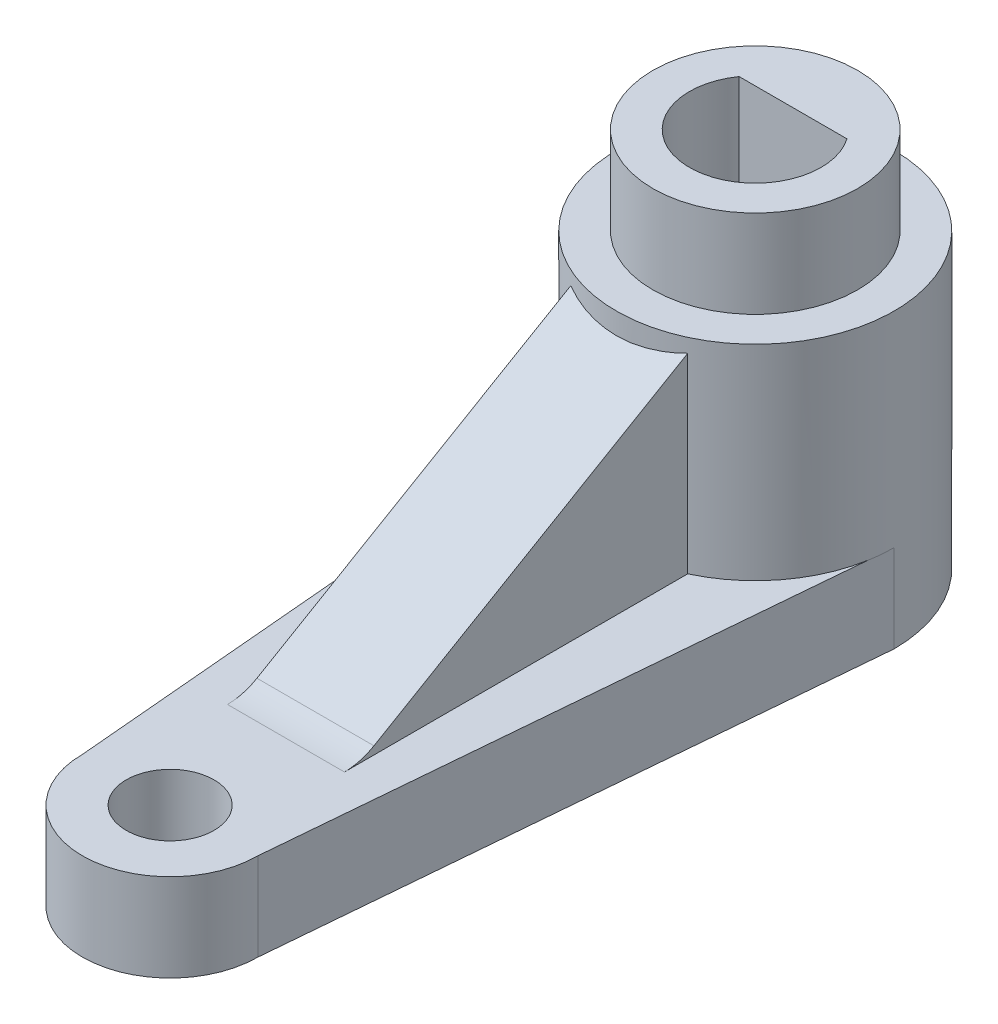
ISO-10303-21;
HEADER;
FILE_DESCRIPTION(('STEP AP214'),'2;1');
FILE_NAME('part.step','',(''),(''),'','','');
FILE_SCHEMA(('AUTOMOTIVE_DESIGN { 1 0 10303 214 1 1 1 1 }'));
ENDSEC;
DATA;
#1=APPLICATION_CONTEXT('core data for automotive mechanical design processes');
#2=APPLICATION_PROTOCOL_DEFINITION('international standard','automotive_design',2000,#1);
#3=PRODUCT_CONTEXT('',#1,'mechanical');
#4=PRODUCT('Part','Part','',(#3));
#5=PRODUCT_RELATED_PRODUCT_CATEGORY('part','',(#4));
#6=PRODUCT_DEFINITION_FORMATION('','',#4);
#7=PRODUCT_DEFINITION_CONTEXT('part definition',#1,'design');
#8=PRODUCT_DEFINITION('design','',#6,#7);
#9=PRODUCT_DEFINITION_SHAPE('','',#8);
#10=(LENGTH_UNIT() NAMED_UNIT(*) SI_UNIT(.MILLI.,.METRE.));
#11=(NAMED_UNIT(*) PLANE_ANGLE_UNIT() SI_UNIT($,.RADIAN.));
#12=(NAMED_UNIT(*) SI_UNIT($,.STERADIAN.) SOLID_ANGLE_UNIT());
#13=UNCERTAINTY_MEASURE_WITH_UNIT(LENGTH_MEASURE(1.E-05),#10,'distance_accuracy_value','');
#14=(GEOMETRIC_REPRESENTATION_CONTEXT(3) GLOBAL_UNCERTAINTY_ASSIGNED_CONTEXT((#13)) GLOBAL_UNIT_ASSIGNED_CONTEXT((#10,
#11,#12)) REPRESENTATION_CONTEXT('',''));
#15=CARTESIAN_POINT('',(0.,0.,0.));
#16=DIRECTION('',(0.,0.,1.));
#17=DIRECTION('',(1.,0.,0.));
#18=AXIS2_PLACEMENT_3D('',#15,#16,#17);
#19=CARTESIAN_POINT('',(0.,13.,0.));
#20=DIRECTION('',(0.,-1.,0.));
#21=DIRECTION('',(0.,0.,1.));
#22=AXIS2_PLACEMENT_3D('',#19,#20,#21);
#23=CYLINDRICAL_SURFACE('',#22,3.5);
#24=CARTESIAN_POINT('',(0.,13.,0.));
#25=DIRECTION('',(0.,-1.,0.));
#26=DIRECTION('',(0.,0.,-1.));
#27=AXIS2_PLACEMENT_3D('',#24,#25,#26);
#28=CIRCLE('',#27,3.5);
#29=CARTESIAN_POINT('',(0.,13.,-3.5));
#30=VERTEX_POINT('',#29);
#31=EDGE_CURVE('E223',#30,#30,#28,.T.);
#32=ORIENTED_EDGE('',*,*,#31,.T.);
#33=EDGE_LOOP('',(#32));
#34=FACE_BOUND('',#33,.T.);
#35=CARTESIAN_POINT('',(0.,10.,0.));
#36=DIRECTION('',(0.,-1.,0.));
#37=DIRECTION('',(0.,0.,-1.));
#38=AXIS2_PLACEMENT_3D('',#35,#36,#37);
#39=CIRCLE('',#38,3.5);
#40=CARTESIAN_POINT('',(0.,10.,-3.5));
#41=VERTEX_POINT('',#40);
#42=EDGE_CURVE('E298',#41,#41,#39,.T.);
#43=ORIENTED_EDGE('',*,*,#42,.F.);
#44=EDGE_LOOP('',(#43));
#45=FACE_BOUND('',#44,.T.);
#46=ADVANCED_FACE('F43',(#34,#45),#23,.T.);
#47=CARTESIAN_POINT('',(0.,3.,0.));
#48=DIRECTION('',(0.,-1.,0.));
#49=DIRECTION('',(0.,0.,1.));
#50=AXIS2_PLACEMENT_3D('',#47,#48,#49);
#51=CYLINDRICAL_SURFACE('',#50,2.25);
#52=DIRECTION('',(0.,-1.,0.));
#53=VECTOR('',#52,1.);
#54=CARTESIAN_POINT('',(-1.84347497948846,3.,-1.29));
#55=LINE('',#54,#53);
#56=CARTESIAN_POINT('',(-1.84347497948846,13.,-1.29));
#57=VERTEX_POINT('',#56);
#58=CARTESIAN_POINT('',(-1.84347497948846,1.5,-1.29));
#59=VERTEX_POINT('',#58);
#60=EDGE_CURVE('E236',#57,#59,#55,.T.);
#61=ORIENTED_EDGE('',*,*,#60,.F.);
#62=CARTESIAN_POINT('',(0.,13.,0.));
#63=DIRECTION('',(0.,-1.,0.));
#64=DIRECTION('',(0.,0.,-1.));
#65=AXIS2_PLACEMENT_3D('',#62,#63,#64);
#66=CIRCLE('',#65,2.25);
#67=CARTESIAN_POINT('',(1.84347497948846,13.,-1.29));
#68=VERTEX_POINT('',#67);
#69=EDGE_CURVE('E218',#68,#57,#66,.T.);
#70=ORIENTED_EDGE('',*,*,#69,.F.);
#71=DIRECTION('',(0.,-1.,0.));
#72=VECTOR('',#71,1.);
#73=CARTESIAN_POINT('',(1.84347497948846,3.,-1.29));
#74=LINE('',#73,#72);
#75=CARTESIAN_POINT('',(1.84347497948846,1.5,-1.29));
#76=VERTEX_POINT('',#75);
#77=EDGE_CURVE('E253',#68,#76,#74,.T.);
#78=ORIENTED_EDGE('',*,*,#77,.T.);
#79=CARTESIAN_POINT('',(0.,1.5,0.));
#80=DIRECTION('',(0.,1.,0.));
#81=DIRECTION('',(0.,0.,1.));
#82=AXIS2_PLACEMENT_3D('',#79,#80,#81);
#83=CIRCLE('',#82,2.25);
#84=EDGE_CURVE('E209',#59,#76,#83,.T.);
#85=ORIENTED_EDGE('',*,*,#84,.F.);
#86=EDGE_LOOP('',(#61,#70,#78,#85));
#87=FACE_BOUND('',#86,.T.);
#88=ADVANCED_FACE('F344',(#87),#51,.F.);
#89=CARTESIAN_POINT('',(0.,3.,-1.29));
#90=DIRECTION('',(0.,0.,1.));
#91=DIRECTION('',(-1.,0.,0.));
#92=AXIS2_PLACEMENT_3D('',#89,#90,#91);
#93=PLANE('',#92);
#94=ORIENTED_EDGE('',*,*,#77,.F.);
#95=DIRECTION('',(1.,0.,0.));
#96=VECTOR('',#95,1.);
#97=CARTESIAN_POINT('',(-1.84347497948846,13.,-1.29));
#98=LINE('',#97,#96);
#99=EDGE_CURVE('E221',#57,#68,#98,.T.);
#100=ORIENTED_EDGE('',*,*,#99,.F.);
#101=ORIENTED_EDGE('',*,*,#60,.T.);
#102=DIRECTION('',(-1.,0.,0.));
#103=VECTOR('',#102,1.);
#104=CARTESIAN_POINT('',(0.,1.5,-1.29));
#105=LINE('',#104,#103);
#106=EDGE_CURVE('E261',#76,#59,#105,.T.);
#107=ORIENTED_EDGE('',*,*,#106,.F.);
#108=EDGE_LOOP('',(#94,#100,#101,#107));
#109=FACE_BOUND('',#108,.T.);
#110=ADVANCED_FACE('F350',(#109),#93,.T.);
#111=CARTESIAN_POINT('',(0.,13.,0.));
#112=DIRECTION('',(0.,1.,0.));
#113=DIRECTION('',(0.,0.,-1.));
#114=AXIS2_PLACEMENT_3D('',#111,#112,#113);
#115=PLANE('',#114);
#116=ORIENTED_EDGE('',*,*,#31,.F.);
#117=EDGE_LOOP('',(#116));
#118=FACE_BOUND('',#117,.T.);
#119=ORIENTED_EDGE('',*,*,#99,.T.);
#120=ORIENTED_EDGE('',*,*,#69,.T.);
#121=EDGE_LOOP('',(#119,#120));
#122=FACE_BOUND('',#121,.T.);
#123=ADVANCED_FACE('F338',(#118,#122),#115,.T.);
#124=CARTESIAN_POINT('',(0.,1.5,0.));
#125=DIRECTION('',(0.,-1.,0.));
#126=DIRECTION('',(0.,0.,1.));
#127=AXIS2_PLACEMENT_3D('',#124,#125,#126);
#128=PLANE('',#127);
#129=ORIENTED_EDGE('',*,*,#84,.T.);
#130=ORIENTED_EDGE('',*,*,#106,.T.);
#131=EDGE_LOOP('',(#129,#130));
#132=FACE_BOUND('',#131,.T.);
#133=ADVANCED_FACE('F328',(#132),#128,.F.);
#134=CARTESIAN_POINT('',(0.,10.,0.));
#135=DIRECTION('',(0.,1.,0.));
#136=DIRECTION('',(0.,0.,-1.));
#137=AXIS2_PLACEMENT_3D('',#134,#135,#136);
#138=PLANE('',#137);
#139=ORIENTED_EDGE('',*,*,#42,.T.);
#140=EDGE_LOOP('',(#139));
#141=FACE_BOUND('',#140,.T.);
#142=CARTESIAN_POINT('',(0.,10.,0.));
#143=DIRECTION('',(0.,-1.,0.));
#144=DIRECTION('',(0.,0.,-1.));
#145=AXIS2_PLACEMENT_3D('',#142,#143,#144);
#146=CIRCLE('',#145,4.75);
#147=CARTESIAN_POINT('',(0.,10.,-4.75));
#148=VERTEX_POINT('',#147);
#149=EDGE_CURVE('E318',#148,#148,#146,.T.);
#150=ORIENTED_EDGE('',*,*,#149,.F.);
#151=EDGE_LOOP('',(#150));
#152=FACE_BOUND('',#151,.T.);
#153=ADVANCED_FACE('F325',(#141,#152),#138,.T.);
#154=CARTESIAN_POINT('',(0.,3.,0.));
#155=DIRECTION('',(0.,1.,0.));
#156=DIRECTION('',(0.,0.,-1.));
#157=AXIS2_PLACEMENT_3D('',#154,#155,#156);
#158=PLANE('',#157);
#159=CARTESIAN_POINT('',(0.,3.,0.));
#160=DIRECTION('',(0.,-1.,0.));
#161=DIRECTION('',(0.,0.,-1.));
#162=AXIS2_PLACEMENT_3D('',#159,#160,#161);
#163=CIRCLE('',#162,4.75);
#164=CARTESIAN_POINT('',(-4.67781826639789,3.,0.824934098309808));
#165=VERTEX_POINT('',#164);
#166=CARTESIAN_POINT('',(-4.75,3.,0.));
#167=VERTEX_POINT('',#166);
#168=EDGE_CURVE('E321',#165,#167,#163,.T.);
#169=ORIENTED_EDGE('',*,*,#168,.T.);
#170=DIRECTION('',(-0.0871669502809099,0.,-0.996193717496113));
#171=VECTOR('',#170,1.);
#172=CARTESIAN_POINT('',(-4.71390913319894,3.,0.412467049154908));
#173=LINE('',#172,#171);
#174=EDGE_CURVE('E314',#165,#167,#173,.T.);
#175=ORIENTED_EDGE('',*,*,#174,.F.);
#176=EDGE_LOOP('',(#169,#175));
#177=FACE_BOUND('',#176,.T.);
#178=ADVANCED_FACE('F327',(#177),#158,.F.);
#179=DIRECTION('',(0.0871669502809099,0.,-0.996193717496113));
#180=VECTOR('',#179,1.);
#181=CARTESIAN_POINT('',(4.71390913319894,3.,0.412467049154908));
#182=LINE('',#181,#180);
#183=CARTESIAN_POINT('',(4.67781826639789,3.,0.824934098309808));
#184=VERTEX_POINT('',#183);
#185=CARTESIAN_POINT('',(4.75,3.,0.));
#186=VERTEX_POINT('',#185);
#187=EDGE_CURVE('E312',#184,#186,#182,.T.);
#188=ORIENTED_EDGE('',*,*,#187,.T.);
#189=EDGE_CURVE('E319',#186,#184,#163,.T.);
#190=ORIENTED_EDGE('',*,*,#189,.T.);
#191=EDGE_LOOP('',(#188,#190));
#192=FACE_BOUND('',#191,.T.);
#193=ADVANCED_FACE('F335',(#192),#158,.F.);
#194=CARTESIAN_POINT('',(0.,1.,0.));
#195=DIRECTION('',(0.,1.,0.));
#196=DIRECTION('',(0.,0.,-1.));
#197=AXIS2_PLACEMENT_3D('',#194,#195,#196);
#198=PLANE('',#197);
#199=DIRECTION('',(-1.,0.,0.));
#200=VECTOR('',#199,1.);
#201=CARTESIAN_POINT('',(3.,1.,-2.));
#202=LINE('',#201,#200);
#203=CARTESIAN_POINT('',(1.22930936742544,1.,-2.));
#204=VERTEX_POINT('',#203);
#205=CARTESIAN_POINT('',(-1.22930936742545,1.,-2.));
#206=VERTEX_POINT('',#205);
#207=EDGE_CURVE('E202',#204,#206,#202,.T.);
#208=ORIENTED_EDGE('',*,*,#207,.F.);
#209=CARTESIAN_POINT('',(1.22930936742544,1.,-0.5));
#210=DIRECTION('',(0.,-1.,0.));
#211=DIRECTION('',(0.,0.,-1.));
#212=AXIS2_PLACEMENT_3D('',#209,#210,#211);
#213=CIRCLE('',#212,1.5);
#214=CARTESIAN_POINT('',(2.70890025317366,1.,-0.253401519041965));
#215=VERTEX_POINT('',#214);
#216=EDGE_CURVE('E280',#215,#204,#213,.F.);
#217=ORIENTED_EDGE('',*,*,#216,.F.);
#218=DIRECTION('',(0.164398987305357,0.,-0.986393923832144));
#219=VECTOR('',#218,1.);
#220=CARTESIAN_POINT('',(3.,1.,-2.));
#221=LINE('',#220,#219);
#222=CARTESIAN_POINT('',(1.47959088574822,1.,7.12245468551071));
#223=VERTEX_POINT('',#222);
#224=EDGE_CURVE('E199',#223,#215,#221,.T.);
#225=ORIENTED_EDGE('',*,*,#224,.F.);
#226=CARTESIAN_POINT('',(0.,1.,6.87585620455267));
#227=DIRECTION('',(0.,-1.,0.));
#228=DIRECTION('',(0.,0.,-1.));
#229=AXIS2_PLACEMENT_3D('',#226,#227,#228);
#230=CIRCLE('',#229,1.5);
#231=CARTESIAN_POINT('',(-1.47959088574821,1.,7.1224546855107));
#232=VERTEX_POINT('',#231);
#233=EDGE_CURVE('E277',#232,#223,#230,.F.);
#234=ORIENTED_EDGE('',*,*,#233,.F.);
#235=DIRECTION('',(0.164398987305357,0.,0.986393923832144));
#236=VECTOR('',#235,1.);
#237=CARTESIAN_POINT('',(-3.,1.,-2.));
#238=LINE('',#237,#236);
#239=CARTESIAN_POINT('',(-2.70890025317366,1.,-0.253401519041964));
#240=VERTEX_POINT('',#239);
#241=EDGE_CURVE('E206',#240,#232,#238,.T.);
#242=ORIENTED_EDGE('',*,*,#241,.F.);
#243=CARTESIAN_POINT('',(-1.22930936742544,1.,-0.5));
#244=DIRECTION('',(0.,-1.,0.));
#245=DIRECTION('',(0.,0.,-1.));
#246=AXIS2_PLACEMENT_3D('',#243,#244,#245);
#247=CIRCLE('',#246,1.5);
#248=EDGE_CURVE('E283',#206,#240,#247,.F.);
#249=ORIENTED_EDGE('',*,*,#248,.F.);
#250=EDGE_LOOP('',(#208,#217,#225,#234,#242,#249));
#251=FACE_BOUND('',#250,.T.);
#252=ADVANCED_FACE('F389',(#251),#198,.F.);
#253=CARTESIAN_POINT('',(-1.22930936742544,1.,-0.5));
#254=DIRECTION('',(0.,1.,0.));
#255=DIRECTION('',(0.,0.,-1.));
#256=AXIS2_PLACEMENT_3D('',#253,#254,#255);
#257=CYLINDRICAL_SURFACE('',#256,1.5);
#258=ORIENTED_EDGE('',*,*,#248,.T.);
#259=DIRECTION('',(0.,-1.,0.));
#260=VECTOR('',#259,1.);
#261=CARTESIAN_POINT('',(-2.70890025317366,0.,-0.253401519041964));
#262=LINE('',#261,#260);
#263=CARTESIAN_POINT('',(-2.70890025317366,0.,-0.253401519041964));
#264=VERTEX_POINT('',#263);
#265=EDGE_CURVE('E269',#240,#264,#262,.T.);
#266=ORIENTED_EDGE('',*,*,#265,.T.);
#267=CARTESIAN_POINT('',(-1.22930936742544,0.,-0.5));
#268=DIRECTION('',(0.,-1.,0.));
#269=DIRECTION('',(0.,0.,-1.));
#270=AXIS2_PLACEMENT_3D('',#267,#268,#269);
#271=CIRCLE('',#270,1.5);
#272=CARTESIAN_POINT('',(-1.22930936742545,0.,-2.));
#273=VERTEX_POINT('',#272);
#274=EDGE_CURVE('E291',#264,#273,#271,.T.);
#275=ORIENTED_EDGE('',*,*,#274,.T.);
#276=DIRECTION('',(0.,-1.,0.));
#277=VECTOR('',#276,1.);
#278=CARTESIAN_POINT('',(-1.22930936742545,1.,-2.));
#279=LINE('',#278,#277);
#280=EDGE_CURVE('E275',#273,#206,#279,.F.);
#281=ORIENTED_EDGE('',*,*,#280,.T.);
#282=EDGE_LOOP('',(#258,#266,#275,#281));
#283=FACE_BOUND('',#282,.T.);
#284=ADVANCED_FACE('F385',(#283),#257,.F.);
#285=CARTESIAN_POINT('',(-3.,1.,-2.));
#286=DIRECTION('',(-0.986393923832144,0.,0.164398987305357));
#287=DIRECTION('',(-0.164398987305357,0.,-0.986393923832144));
#288=AXIS2_PLACEMENT_3D('',#285,#286,#287);
#289=PLANE('',#288);
#290=ORIENTED_EDGE('',*,*,#241,.T.);
#291=DIRECTION('',(0.,-1.,0.));
#292=VECTOR('',#291,1.);
#293=CARTESIAN_POINT('',(-1.47959088574821,1.,7.12245468551071));
#294=LINE('',#293,#292);
#295=CARTESIAN_POINT('',(-1.47959088574821,0.,7.1224546855107));
#296=VERTEX_POINT('',#295);
#297=EDGE_CURVE('E267',#296,#232,#294,.F.);
#298=ORIENTED_EDGE('',*,*,#297,.F.);
#299=DIRECTION('',(0.164398987305357,0.,0.986393923832144));
#300=VECTOR('',#299,1.);
#301=CARTESIAN_POINT('',(-3.,0.,-2.));
#302=LINE('',#301,#300);
#303=EDGE_CURVE('E203',#264,#296,#302,.T.);
#304=ORIENTED_EDGE('',*,*,#303,.F.);
#305=ORIENTED_EDGE('',*,*,#265,.F.);
#306=EDGE_LOOP('',(#290,#298,#304,#305));
#307=FACE_BOUND('',#306,.T.);
#308=ADVANCED_FACE('F388',(#307),#289,.F.);
#309=CARTESIAN_POINT('',(0.,1.,6.87585620455267));
#310=DIRECTION('',(0.,1.,0.));
#311=DIRECTION('',(0.,0.,-1.));
#312=AXIS2_PLACEMENT_3D('',#309,#310,#311);
#313=CYLINDRICAL_SURFACE('',#312,1.5);
#314=ORIENTED_EDGE('',*,*,#233,.T.);
#315=DIRECTION('',(0.,-1.,0.));
#316=VECTOR('',#315,1.);
#317=CARTESIAN_POINT('',(1.47959088574822,0.,7.1224546855107));
#318=LINE('',#317,#316);
#319=CARTESIAN_POINT('',(1.47959088574822,0.,7.12245468551071));
#320=VERTEX_POINT('',#319);
#321=EDGE_CURVE('E286',#223,#320,#318,.T.);
#322=ORIENTED_EDGE('',*,*,#321,.T.);
#323=CARTESIAN_POINT('',(0.,0.,6.87585620455267));
#324=DIRECTION('',(0.,-1.,0.));
#325=DIRECTION('',(0.,0.,-1.));
#326=AXIS2_PLACEMENT_3D('',#323,#324,#325);
#327=CIRCLE('',#326,1.5);
#328=EDGE_CURVE('E296',#320,#296,#327,.T.);
#329=ORIENTED_EDGE('',*,*,#328,.T.);
#330=ORIENTED_EDGE('',*,*,#297,.T.);
#331=EDGE_LOOP('',(#314,#322,#329,#330));
#332=FACE_BOUND('',#331,.T.);
#333=ADVANCED_FACE('F395',(#332),#313,.F.);
#334=CARTESIAN_POINT('',(3.,1.,-2.));
#335=DIRECTION('',(0.986393923832144,0.,0.164398987305357));
#336=DIRECTION('',(-0.164398987305357,0.,0.986393923832144));
#337=AXIS2_PLACEMENT_3D('',#334,#335,#336);
#338=PLANE('',#337);
#339=DIRECTION('',(0.164398987305357,0.,-0.986393923832144));
#340=VECTOR('',#339,1.);
#341=CARTESIAN_POINT('',(3.,0.,-2.));
#342=LINE('',#341,#340);
#343=CARTESIAN_POINT('',(2.70890025317366,0.,-0.253401519041965));
#344=VERTEX_POINT('',#343);
#345=EDGE_CURVE('E198',#320,#344,#342,.T.);
#346=ORIENTED_EDGE('',*,*,#345,.F.);
#347=ORIENTED_EDGE('',*,*,#321,.F.);
#348=ORIENTED_EDGE('',*,*,#224,.T.);
#349=DIRECTION('',(0.,-1.,0.));
#350=VECTOR('',#349,1.);
#351=CARTESIAN_POINT('',(2.70890025317366,1.,-0.253401519041965));
#352=LINE('',#351,#350);
#353=EDGE_CURVE('E289',#344,#215,#352,.F.);
#354=ORIENTED_EDGE('',*,*,#353,.F.);
#355=EDGE_LOOP('',(#346,#347,#348,#354));
#356=FACE_BOUND('',#355,.T.);
#357=ADVANCED_FACE('F393',(#356),#338,.F.);
#358=CARTESIAN_POINT('',(1.22930936742544,1.,-0.5));
#359=DIRECTION('',(0.,1.,0.));
#360=DIRECTION('',(0.,0.,-1.));
#361=AXIS2_PLACEMENT_3D('',#358,#359,#360);
#362=CYLINDRICAL_SURFACE('',#361,1.5);
#363=ORIENTED_EDGE('',*,*,#216,.T.);
#364=DIRECTION('',(0.,-1.,0.));
#365=VECTOR('',#364,1.);
#366=CARTESIAN_POINT('',(1.22930936742544,0.,-2.));
#367=LINE('',#366,#365);
#368=CARTESIAN_POINT('',(1.22930936742544,0.,-2.));
#369=VERTEX_POINT('',#368);
#370=EDGE_CURVE('E272',#204,#369,#367,.T.);
#371=ORIENTED_EDGE('',*,*,#370,.T.);
#372=CARTESIAN_POINT('',(1.22930936742544,0.,-0.5));
#373=DIRECTION('',(0.,-1.,0.));
#374=DIRECTION('',(0.,0.,-1.));
#375=AXIS2_PLACEMENT_3D('',#372,#373,#374);
#376=CIRCLE('',#375,1.5);
#377=EDGE_CURVE('E294',#369,#344,#376,.T.);
#378=ORIENTED_EDGE('',*,*,#377,.T.);
#379=ORIENTED_EDGE('',*,*,#353,.T.);
#380=EDGE_LOOP('',(#363,#371,#378,#379));
#381=FACE_BOUND('',#380,.T.);
#382=ADVANCED_FACE('F391',(#381),#362,.F.);
#383=CARTESIAN_POINT('',(3.,1.,-2.));
#384=DIRECTION('',(0.,0.,-1.));
#385=DIRECTION('',(1.,0.,0.));
#386=AXIS2_PLACEMENT_3D('',#383,#384,#385);
#387=PLANE('',#386);
#388=DIRECTION('',(-1.,0.,0.));
#389=VECTOR('',#388,1.);
#390=CARTESIAN_POINT('',(3.,0.,-2.));
#391=LINE('',#390,#389);
#392=EDGE_CURVE('E212',#369,#273,#391,.T.);
#393=ORIENTED_EDGE('',*,*,#392,.F.);
#394=ORIENTED_EDGE('',*,*,#370,.F.);
#395=ORIENTED_EDGE('',*,*,#207,.T.);
#396=ORIENTED_EDGE('',*,*,#280,.F.);
#397=EDGE_LOOP('',(#393,#394,#395,#396));
#398=FACE_BOUND('',#397,.T.);
#399=ADVANCED_FACE('F383',(#398),#387,.F.);
#400=CARTESIAN_POINT('',(0.,3.,20.));
#401=DIRECTION('',(0.,-1.,0.));
#402=DIRECTION('',(0.,0.,1.));
#403=AXIS2_PLACEMENT_3D('',#400,#401,#402);
#404=CYLINDRICAL_SURFACE('',#403,1.5);
#405=CARTESIAN_POINT('',(0.,3.,20.));
#406=DIRECTION('',(0.,-1.,0.));
#407=DIRECTION('',(0.,0.,-1.));
#408=AXIS2_PLACEMENT_3D('',#405,#406,#407);
#409=CIRCLE('',#408,1.5);
#410=CARTESIAN_POINT('',(0.,3.,18.5));
#411=VERTEX_POINT('',#410);
#412=EDGE_CURVE('E227',#411,#411,#409,.T.);
#413=ORIENTED_EDGE('',*,*,#412,.F.);
#414=EDGE_LOOP('',(#413));
#415=FACE_BOUND('',#414,.T.);
#416=CARTESIAN_POINT('',(0.,0.,20.));
#417=DIRECTION('',(0.,-1.,0.));
#418=DIRECTION('',(0.,0.,-1.));
#419=AXIS2_PLACEMENT_3D('',#416,#417,#418);
#420=CIRCLE('',#419,1.5);
#421=CARTESIAN_POINT('',(0.,0.,18.5));
#422=VERTEX_POINT('',#421);
#423=EDGE_CURVE('E226',#422,#422,#420,.T.);
#424=ORIENTED_EDGE('',*,*,#423,.T.);
#425=EDGE_LOOP('',(#424));
#426=FACE_BOUND('',#425,.T.);
#427=ADVANCED_FACE('F373',(#415,#426),#404,.F.);
#428=CARTESIAN_POINT('',(0.,3.,20.));
#429=DIRECTION('',(0.,-1.,0.));
#430=DIRECTION('',(0.,0.,1.));
#431=AXIS2_PLACEMENT_3D('',#428,#429,#430);
#432=CYLINDRICAL_SURFACE('',#431,3.);
#433=CARTESIAN_POINT('',(0.,0.,20.));
#434=DIRECTION('',(0.,-1.,0.));
#435=DIRECTION('',(0.,0.,-1.));
#436=AXIS2_PLACEMENT_3D('',#433,#434,#435);
#437=CIRCLE('',#436,3.);
#438=CARTESIAN_POINT('',(3.,0.,20.));
#439=VERTEX_POINT('',#438);
#440=CARTESIAN_POINT('',(-3.,0.,20.));
#441=VERTEX_POINT('',#440);
#442=EDGE_CURVE('E242',#439,#441,#437,.T.);
#443=ORIENTED_EDGE('',*,*,#442,.F.);
#444=DIRECTION('',(0.,-1.,0.));
#445=VECTOR('',#444,1.);
#446=CARTESIAN_POINT('',(3.,3.,20.));
#447=LINE('',#446,#445);
#448=CARTESIAN_POINT('',(3.,3.,20.));
#449=VERTEX_POINT('',#448);
#450=EDGE_CURVE('E258',#449,#439,#447,.T.);
#451=ORIENTED_EDGE('',*,*,#450,.F.);
#452=CARTESIAN_POINT('',(0.,3.,20.));
#453=DIRECTION('',(0.,-1.,0.));
#454=DIRECTION('',(0.,0.,-1.));
#455=AXIS2_PLACEMENT_3D('',#452,#453,#454);
#456=CIRCLE('',#455,3.);
#457=CARTESIAN_POINT('',(-3.,3.,20.));
#458=VERTEX_POINT('',#457);
#459=EDGE_CURVE('E232',#449,#458,#456,.T.);
#460=ORIENTED_EDGE('',*,*,#459,.T.);
#461=DIRECTION('',(0.,-1.,0.));
#462=VECTOR('',#461,1.);
#463=CARTESIAN_POINT('',(-3.,3.,20.));
#464=LINE('',#463,#462);
#465=EDGE_CURVE('E255',#458,#441,#464,.T.);
#466=ORIENTED_EDGE('',*,*,#465,.T.);
#467=EDGE_LOOP('',(#443,#451,#460,#466));
#468=FACE_BOUND('',#467,.T.);
#469=ADVANCED_FACE('F364',(#468),#432,.T.);
#470=CARTESIAN_POINT('',(0.,0.,0.));
#471=DIRECTION('',(0.,1.,0.));
#472=DIRECTION('',(0.,0.,-1.));
#473=AXIS2_PLACEMENT_3D('',#470,#471,#472);
#474=PLANE('',#473);
#475=ORIENTED_EDGE('',*,*,#392,.T.);
#476=ORIENTED_EDGE('',*,*,#274,.F.);
#477=ORIENTED_EDGE('',*,*,#303,.T.);
#478=ORIENTED_EDGE('',*,*,#328,.F.);
#479=ORIENTED_EDGE('',*,*,#345,.T.);
#480=ORIENTED_EDGE('',*,*,#377,.F.);
#481=EDGE_LOOP('',(#475,#476,#477,#478,#479,#480));
#482=FACE_BOUND('',#481,.T.);
#483=ORIENTED_EDGE('',*,*,#423,.F.);
#484=EDGE_LOOP('',(#483));
#485=FACE_BOUND('',#484,.T.);
#486=DIRECTION('',(0.0871669502809099,0.,-0.996193717496113));
#487=VECTOR('',#486,1.);
#488=CARTESIAN_POINT('',(4.71390913319894,0.,0.412467049154908));
#489=LINE('',#488,#487);
#490=CARTESIAN_POINT('',(4.75,0.,0.));
#491=VERTEX_POINT('',#490);
#492=EDGE_CURVE('E239',#439,#491,#489,.T.);
#493=ORIENTED_EDGE('',*,*,#492,.F.);
#494=ORIENTED_EDGE('',*,*,#442,.T.);
#495=DIRECTION('',(-0.0871669502809099,0.,-0.996193717496113));
#496=VECTOR('',#495,1.);
#497=CARTESIAN_POINT('',(-4.71390913319894,0.,0.412467049154908));
#498=LINE('',#497,#496);
#499=CARTESIAN_POINT('',(-4.75,0.,0.));
#500=VERTEX_POINT('',#499);
#501=EDGE_CURVE('E245',#441,#500,#498,.T.);
#502=ORIENTED_EDGE('',*,*,#501,.T.);
#503=CARTESIAN_POINT('',(0.,0.,0.));
#504=DIRECTION('',(0.,-1.,0.));
#505=DIRECTION('',(0.,0.,-1.));
#506=AXIS2_PLACEMENT_3D('',#503,#504,#505);
#507=CIRCLE('',#506,4.75);
#508=EDGE_CURVE('E230',#500,#491,#507,.T.);
#509=ORIENTED_EDGE('',*,*,#508,.T.);
#510=EDGE_LOOP('',(#493,#494,#502,#509));
#511=FACE_BOUND('',#510,.T.);
#512=ADVANCED_FACE('F361',(#482,#485,#511),#474,.F.);
#513=CARTESIAN_POINT('',(-5.,5.,16.0406982826999));
#514=DIRECTION('',(-1.,0.,0.));
#515=DIRECTION('',(0.,0.,-1.));
#516=AXIS2_PLACEMENT_3D('',#513,#514,#515);
#517=CYLINDRICAL_SURFACE('',#516,2.);
#518=CARTESIAN_POINT('',(2.,5.,16.0406982826999));
#519=DIRECTION('',(1.,0.,0.));
#520=DIRECTION('',(0.,0.,-1.));
#521=AXIS2_PLACEMENT_3D('',#518,#519,#520);
#522=CIRCLE('',#521,2.);
#523=CARTESIAN_POINT('',(2.,3.,16.0406982826999));
#524=VERTEX_POINT('',#523);
#525=CARTESIAN_POINT('',(2.,3.27244219820313,15.0329562316518));
#526=VERTEX_POINT('',#525);
#527=EDGE_CURVE('E51',#524,#526,#522,.T.);
#528=ORIENTED_EDGE('',*,*,#527,.T.);
#529=DIRECTION('',(-1.,0.,0.));
#530=VECTOR('',#529,1.);
#531=CARTESIAN_POINT('',(-5.,3.27244219820313,15.0329562316518));
#532=LINE('',#531,#530);
#533=CARTESIAN_POINT('',(-2.,3.27244219820313,15.0329562316518));
#534=VERTEX_POINT('',#533);
#535=EDGE_CURVE('E188',#526,#534,#532,.T.);
#536=ORIENTED_EDGE('',*,*,#535,.T.);
#537=CARTESIAN_POINT('',(-2.,5.,16.0406982826999));
#538=DIRECTION('',(-1.,0.,0.));
#539=DIRECTION('',(0.,0.,1.));
#540=AXIS2_PLACEMENT_3D('',#537,#538,#539);
#541=CIRCLE('',#540,2.);
#542=CARTESIAN_POINT('',(-2.,3.,16.0406982826999));
#543=VERTEX_POINT('',#542);
#544=EDGE_CURVE('E180',#534,#543,#541,.T.);
#545=ORIENTED_EDGE('',*,*,#544,.T.);
#546=DIRECTION('',(-1.,0.,0.));
#547=VECTOR('',#546,1.);
#548=CARTESIAN_POINT('',(0.,3.,16.0406982826999));
#549=LINE('',#548,#547);
#550=EDGE_CURVE('E302',#543,#524,#549,.F.);
#551=ORIENTED_EDGE('',*,*,#550,.T.);
#552=EDGE_LOOP('',(#528,#536,#545,#551));
#553=FACE_BOUND('',#552,.T.);
#554=ADVANCED_FACE('F45',(#553),#517,.F.);
#555=CARTESIAN_POINT('',(-5.,10.,3.5));
#556=DIRECTION('',(0.,-0.863778900898433,-0.503871025524086));
#557=DIRECTION('',(0.,-0.503871025524086,0.863778900898434));
#558=AXIS2_PLACEMENT_3D('',#555,#556,#557);
#559=PLANE('',#558);
#560=CARTESIAN_POINT('',(0.,12.0416666666667,0.));
#561=DIRECTION('',(0.,0.863778900898433,0.503871025524086));
#562=DIRECTION('',(0.,-0.503871025524086,0.863778900898434));
#563=AXIS2_PLACEMENT_3D('',#560,#561,#562);
#564=ELLIPSE('',#563,5.49909241249055,4.75);
#565=CARTESIAN_POINT('',(2.,9.52842050880628,4.30842198490352));
#566=VERTEX_POINT('',#565);
#567=CARTESIAN_POINT('',(-2.,9.52842050880628,4.30842198490352));
#568=VERTEX_POINT('',#567);
#569=EDGE_CURVE('E11',#566,#568,#564,.F.);
#570=ORIENTED_EDGE('',*,*,#569,.T.);
#571=DIRECTION('',(0.,-0.503871025524086,0.863778900898434));
#572=VECTOR('',#571,1.);
#573=CARTESIAN_POINT('',(-2.,4.77720207253886,12.4533678756477));
#574=LINE('',#573,#572);
#575=EDGE_CURVE('E177',#568,#534,#574,.T.);
#576=ORIENTED_EDGE('',*,*,#575,.T.);
#577=ORIENTED_EDGE('',*,*,#535,.F.);
#578=DIRECTION('',(0.,-0.503871025524086,0.863778900898433));
#579=VECTOR('',#578,1.);
#580=CARTESIAN_POINT('',(2.,10.,3.5));
#581=LINE('',#580,#579);
#582=EDGE_CURVE('E173',#566,#526,#581,.T.);
#583=ORIENTED_EDGE('',*,*,#582,.F.);
#584=EDGE_LOOP('',(#570,#576,#577,#583));
#585=FACE_BOUND('',#584,.T.);
#586=ADVANCED_FACE('F187',(#585),#559,.F.);
#587=CARTESIAN_POINT('',(2.,10.,15.5));
#588=DIRECTION('',(-1.,0.,0.));
#589=DIRECTION('',(0.,0.,-1.));
#590=AXIS2_PLACEMENT_3D('',#587,#588,#589);
#591=PLANE('',#590);
#592=DIRECTION('',(0.,-1.,0.));
#593=VECTOR('',#592,1.);
#594=CARTESIAN_POINT('',(2.,10.,4.30842198490352));
#595=LINE('',#594,#593);
#596=CARTESIAN_POINT('',(2.,3.,4.30842198490352));
#597=VERTEX_POINT('',#596);
#598=EDGE_CURVE('E174',#597,#566,#595,.F.);
#599=ORIENTED_EDGE('',*,*,#598,.T.);
#600=ORIENTED_EDGE('',*,*,#582,.T.);
#601=ORIENTED_EDGE('',*,*,#527,.F.);
#602=DIRECTION('',(0.,0.,1.));
#603=VECTOR('',#602,1.);
#604=CARTESIAN_POINT('',(2.,3.,15.5));
#605=LINE('',#604,#603);
#606=EDGE_CURVE('E196',#597,#524,#605,.T.);
#607=ORIENTED_EDGE('',*,*,#606,.F.);
#608=EDGE_LOOP('',(#599,#600,#601,#607));
#609=FACE_BOUND('',#608,.T.);
#610=ADVANCED_FACE('F308',(#609),#591,.F.);
#611=CARTESIAN_POINT('',(-2.,10.,15.5));
#612=DIRECTION('',(1.,0.,0.));
#613=DIRECTION('',(0.,0.,1.));
#614=AXIS2_PLACEMENT_3D('',#611,#612,#613);
#615=PLANE('',#614);
#616=DIRECTION('',(0.,-1.,0.));
#617=VECTOR('',#616,1.);
#618=CARTESIAN_POINT('',(-2.,10.,4.30842198490352));
#619=LINE('',#618,#617);
#620=CARTESIAN_POINT('',(-2.,3.,4.30842198490352));
#621=VERTEX_POINT('',#620);
#622=EDGE_CURVE('E163',#568,#621,#619,.T.);
#623=ORIENTED_EDGE('',*,*,#622,.T.);
#624=DIRECTION('',(0.,0.,-1.));
#625=VECTOR('',#624,1.);
#626=CARTESIAN_POINT('',(-2.,3.,15.5));
#627=LINE('',#626,#625);
#628=EDGE_CURVE('E184',#543,#621,#627,.T.);
#629=ORIENTED_EDGE('',*,*,#628,.F.);
#630=ORIENTED_EDGE('',*,*,#544,.F.);
#631=ORIENTED_EDGE('',*,*,#575,.F.);
#632=EDGE_LOOP('',(#623,#629,#630,#631));
#633=FACE_BOUND('',#632,.T.);
#634=ADVANCED_FACE('F178',(#633),#615,.F.);
#635=CARTESIAN_POINT('',(0.,3.,0.));
#636=DIRECTION('',(0.,-1.,0.));
#637=DIRECTION('',(0.,0.,1.));
#638=AXIS2_PLACEMENT_3D('',#635,#636,#637);
#639=CYLINDRICAL_SURFACE('',#638,4.75);
#640=ORIENTED_EDGE('',*,*,#508,.F.);
#641=DIRECTION('',(0.,-1.,0.));
#642=VECTOR('',#641,1.);
#643=CARTESIAN_POINT('',(-4.75,3.,0.));
#644=LINE('',#643,#642);
#645=EDGE_CURVE('E252',#167,#500,#644,.T.);
#646=ORIENTED_EDGE('',*,*,#645,.F.);
#647=ORIENTED_EDGE('',*,*,#168,.F.);
#648=EDGE_CURVE('E170',#621,#165,#163,.T.);
#649=ORIENTED_EDGE('',*,*,#648,.F.);
#650=ORIENTED_EDGE('',*,*,#622,.F.);
#651=ORIENTED_EDGE('',*,*,#569,.F.);
#652=ORIENTED_EDGE('',*,*,#598,.F.);
#653=EDGE_CURVE('E310',#184,#597,#163,.T.);
#654=ORIENTED_EDGE('',*,*,#653,.F.);
#655=ORIENTED_EDGE('',*,*,#189,.F.);
#656=DIRECTION('',(0.,-1.,0.));
#657=VECTOR('',#656,1.);
#658=CARTESIAN_POINT('',(4.75,3.,0.));
#659=LINE('',#658,#657);
#660=EDGE_CURVE('E250',#186,#491,#659,.T.);
#661=ORIENTED_EDGE('',*,*,#660,.T.);
#662=EDGE_LOOP('',(#640,#646,#647,#649,#650,#651,#652,#654,#655,#661));
#663=FACE_BOUND('',#662,.T.);
#664=ORIENTED_EDGE('',*,*,#149,.T.);
#665=EDGE_LOOP('',(#664));
#666=FACE_BOUND('',#665,.T.);
#667=ADVANCED_FACE('F166',(#663,#666),#639,.T.);
#668=CARTESIAN_POINT('',(-4.71390913319894,3.,0.412467049154908));
#669=DIRECTION('',(0.996193717496113,0.,-0.0871669502809099));
#670=DIRECTION('',(0.0871669502809099,0.,0.996193717496113));
#671=AXIS2_PLACEMENT_3D('',#668,#669,#670);
#672=PLANE('',#671);
#673=ORIENTED_EDGE('',*,*,#501,.F.);
#674=ORIENTED_EDGE('',*,*,#465,.F.);
#675=DIRECTION('',(-0.0871669502809099,0.,-0.996193717496113));
#676=VECTOR('',#675,1.);
#677=CARTESIAN_POINT('',(-4.71390913319894,3.,0.412467049154908));
#678=LINE('',#677,#676);
#679=EDGE_CURVE('E66',#458,#165,#678,.T.);
#680=ORIENTED_EDGE('',*,*,#679,.T.);
#681=ORIENTED_EDGE('',*,*,#174,.T.);
#682=ORIENTED_EDGE('',*,*,#645,.T.);
#683=EDGE_LOOP('',(#673,#674,#680,#681,#682));
#684=FACE_BOUND('',#683,.T.);
#685=ADVANCED_FACE('F368',(#684),#672,.F.);
#686=CARTESIAN_POINT('',(4.71390913319894,3.,0.412467049154908));
#687=DIRECTION('',(0.996193717496113,0.,0.0871669502809099));
#688=DIRECTION('',(-0.0871669502809099,0.,0.996193717496113));
#689=AXIS2_PLACEMENT_3D('',#686,#687,#688);
#690=PLANE('',#689);
#691=ORIENTED_EDGE('',*,*,#492,.T.);
#692=ORIENTED_EDGE('',*,*,#660,.F.);
#693=ORIENTED_EDGE('',*,*,#187,.F.);
#694=DIRECTION('',(0.0871669502809099,0.,-0.996193717496113));
#695=VECTOR('',#694,1.);
#696=CARTESIAN_POINT('',(4.71390913319894,3.,0.412467049154908));
#697=LINE('',#696,#695);
#698=EDGE_CURVE('E58',#449,#184,#697,.T.);
#699=ORIENTED_EDGE('',*,*,#698,.F.);
#700=ORIENTED_EDGE('',*,*,#450,.T.);
#701=EDGE_LOOP('',(#691,#692,#693,#699,#700));
#702=FACE_BOUND('',#701,.T.);
#703=ADVANCED_FACE('F359',(#702),#690,.T.);
#704=CARTESIAN_POINT('',(0.,3.,0.));
#705=DIRECTION('',(0.,1.,0.));
#706=DIRECTION('',(0.,0.,-1.));
#707=AXIS2_PLACEMENT_3D('',#704,#705,#706);
#708=PLANE('',#707);
#709=ORIENTED_EDGE('',*,*,#412,.T.);
#710=EDGE_LOOP('',(#709));
#711=FACE_BOUND('',#710,.T.);
#712=ORIENTED_EDGE('',*,*,#679,.F.);
#713=ORIENTED_EDGE('',*,*,#459,.F.);
#714=ORIENTED_EDGE('',*,*,#698,.T.);
#715=ORIENTED_EDGE('',*,*,#653,.T.);
#716=ORIENTED_EDGE('',*,*,#606,.T.);
#717=ORIENTED_EDGE('',*,*,#550,.F.);
#718=ORIENTED_EDGE('',*,*,#628,.T.);
#719=ORIENTED_EDGE('',*,*,#648,.T.);
#720=EDGE_LOOP('',(#712,#713,#714,#715,#716,#717,#718,#719));
#721=FACE_BOUND('',#720,.T.);
#722=ADVANCED_FACE('F356',(#711,#721),#708,.T.);
#723=CLOSED_SHELL('',(#46,#88,#110,#123,#133,#153,#178,#193,#252,#284,#308,#333,#357,#382,#399,
#427,#469,#512,#554,#586,#610,#634,#667,#685,#703,#722));
#724=MANIFOLD_SOLID_BREP('B2',#723);
#725=ADVANCED_BREP_SHAPE_REPRESENTATION('',(#18,#724),#14);
#726=SHAPE_DEFINITION_REPRESENTATION(#9,#725);
ENDSEC;
END-ISO-10303-21;
